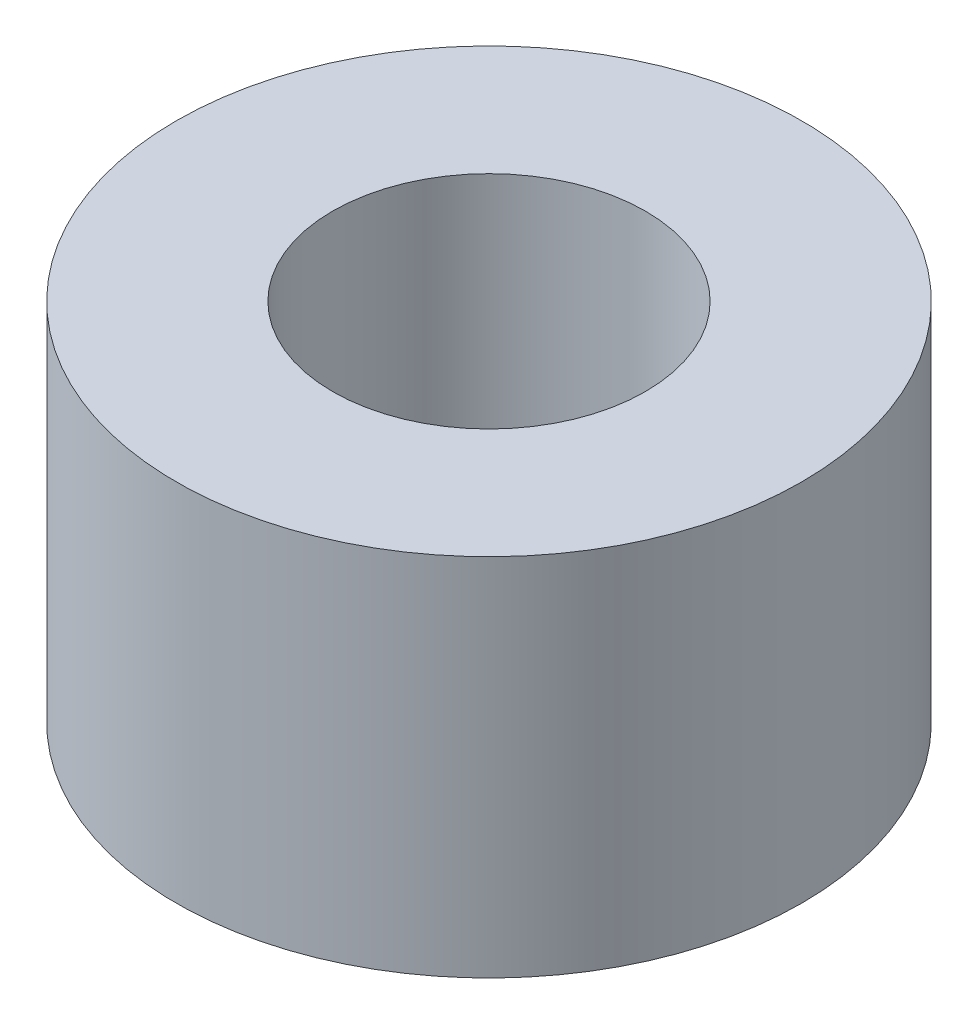
ISO-10303-21;
HEADER;
FILE_DESCRIPTION(('STEP AP214'),'2;1');
FILE_NAME('part.step','',(''),(''),'','','');
FILE_SCHEMA(('AUTOMOTIVE_DESIGN { 1 0 10303 214 1 1 1 1 }'));
ENDSEC;
DATA;
#1=APPLICATION_CONTEXT('core data for automotive mechanical design processes');
#2=APPLICATION_PROTOCOL_DEFINITION('international standard','automotive_design',2000,#1);
#3=PRODUCT_CONTEXT('',#1,'mechanical');
#4=PRODUCT('Part','Part','',(#3));
#5=PRODUCT_RELATED_PRODUCT_CATEGORY('part','',(#4));
#6=PRODUCT_DEFINITION_FORMATION('','',#4);
#7=PRODUCT_DEFINITION_CONTEXT('part definition',#1,'design');
#8=PRODUCT_DEFINITION('design','',#6,#7);
#9=PRODUCT_DEFINITION_SHAPE('','',#8);
#10=(LENGTH_UNIT() NAMED_UNIT(*) SI_UNIT(.MILLI.,.METRE.));
#11=(NAMED_UNIT(*) PLANE_ANGLE_UNIT() SI_UNIT($,.RADIAN.));
#12=(NAMED_UNIT(*) SI_UNIT($,.STERADIAN.) SOLID_ANGLE_UNIT());
#13=UNCERTAINTY_MEASURE_WITH_UNIT(LENGTH_MEASURE(1.E-05),#10,'distance_accuracy_value','');
#14=(GEOMETRIC_REPRESENTATION_CONTEXT(3) GLOBAL_UNCERTAINTY_ASSIGNED_CONTEXT((#13)) GLOBAL_UNIT_ASSIGNED_CONTEXT((#10,
#11,#12)) REPRESENTATION_CONTEXT('',''));
#15=CARTESIAN_POINT('',(0.,0.,0.));
#16=DIRECTION('',(0.,0.,1.));
#17=DIRECTION('',(1.,0.,0.));
#18=AXIS2_PLACEMENT_3D('',#15,#16,#17);
#19=CARTESIAN_POINT('',(0.,70.,0.));
#20=DIRECTION('',(0.,1.,0.));
#21=DIRECTION('',(0.,0.,1.));
#22=AXIS2_PLACEMENT_3D('',#19,#20,#21);
#23=PLANE('',#22);
#24=CARTESIAN_POINT('',(0.,70.,0.));
#25=DIRECTION('',(0.,1.,0.));
#26=DIRECTION('',(1.,0.,0.));
#27=AXIS2_PLACEMENT_3D('',#24,#25,#26);
#28=CIRCLE('',#27,60.);
#29=CARTESIAN_POINT('',(60.,70.,0.));
#30=VERTEX_POINT('',#29);
#31=EDGE_CURVE('E11',#30,#30,#28,.T.);
#32=ORIENTED_EDGE('',*,*,#31,.T.);
#33=EDGE_LOOP('',(#32));
#34=FACE_BOUND('',#33,.T.);
#35=CARTESIAN_POINT('',(0.,70.,0.));
#36=DIRECTION('',(0.,1.,0.));
#37=DIRECTION('',(0.,0.,1.));
#38=AXIS2_PLACEMENT_3D('',#35,#36,#37);
#39=CIRCLE('',#38,30.);
#40=CARTESIAN_POINT('',(0.,70.,30.));
#41=VERTEX_POINT('',#40);
#42=EDGE_CURVE('E52',#41,#41,#39,.T.);
#43=ORIENTED_EDGE('',*,*,#42,.F.);
#44=EDGE_LOOP('',(#43));
#45=FACE_BOUND('',#44,.T.);
#46=ADVANCED_FACE('F41',(#34,#45),#23,.T.);
#47=CARTESIAN_POINT('',(0.,0.,0.));
#48=DIRECTION('',(0.,1.,0.));
#49=DIRECTION('',(0.,0.,1.));
#50=AXIS2_PLACEMENT_3D('',#47,#48,#49);
#51=PLANE('',#50);
#52=CARTESIAN_POINT('',(0.,0.,0.));
#53=DIRECTION('',(0.,1.,0.));
#54=DIRECTION('',(1.,0.,0.));
#55=AXIS2_PLACEMENT_3D('',#52,#53,#54);
#56=CIRCLE('',#55,60.);
#57=CARTESIAN_POINT('',(60.,0.,0.));
#58=VERTEX_POINT('',#57);
#59=EDGE_CURVE('E45',#58,#58,#56,.T.);
#60=ORIENTED_EDGE('',*,*,#59,.F.);
#61=EDGE_LOOP('',(#60));
#62=FACE_BOUND('',#61,.T.);
#63=CARTESIAN_POINT('',(0.,0.,0.));
#64=DIRECTION('',(0.,1.,0.));
#65=DIRECTION('',(0.,0.,1.));
#66=AXIS2_PLACEMENT_3D('',#63,#64,#65);
#67=CIRCLE('',#66,30.);
#68=CARTESIAN_POINT('',(0.,0.,30.));
#69=VERTEX_POINT('',#68);
#70=EDGE_CURVE('E54',#69,#69,#67,.T.);
#71=ORIENTED_EDGE('',*,*,#70,.T.);
#72=EDGE_LOOP('',(#71));
#73=FACE_BOUND('',#72,.T.);
#74=ADVANCED_FACE('F64',(#62,#73),#51,.F.);
#75=CARTESIAN_POINT('',(0.,70.,0.));
#76=DIRECTION('',(0.,-1.,0.));
#77=DIRECTION('',(0.,0.,-1.));
#78=AXIS2_PLACEMENT_3D('',#75,#76,#77);
#79=CYLINDRICAL_SURFACE('',#78,60.);
#80=ORIENTED_EDGE('',*,*,#31,.F.);
#81=EDGE_LOOP('',(#80));
#82=FACE_BOUND('',#81,.T.);
#83=ORIENTED_EDGE('',*,*,#59,.T.);
#84=EDGE_LOOP('',(#83));
#85=FACE_BOUND('',#84,.T.);
#86=ADVANCED_FACE('F43',(#82,#85),#79,.T.);
#87=CARTESIAN_POINT('',(0.,70.,0.));
#88=DIRECTION('',(0.,-1.,0.));
#89=DIRECTION('',(0.,0.,-1.));
#90=AXIS2_PLACEMENT_3D('',#87,#88,#89);
#91=CYLINDRICAL_SURFACE('',#90,30.);
#92=ORIENTED_EDGE('',*,*,#42,.T.);
#93=EDGE_LOOP('',(#92));
#94=FACE_BOUND('',#93,.T.);
#95=ORIENTED_EDGE('',*,*,#70,.F.);
#96=EDGE_LOOP('',(#95));
#97=FACE_BOUND('',#96,.T.);
#98=ADVANCED_FACE('F60',(#94,#97),#91,.F.);
#99=CLOSED_SHELL('',(#46,#74,#86,#98));
#100=MANIFOLD_SOLID_BREP('B2',#99);
#101=ADVANCED_BREP_SHAPE_REPRESENTATION('',(#18,#100),#14);
#102=SHAPE_DEFINITION_REPRESENTATION(#9,#101);
ENDSEC;
END-ISO-10303-21;
